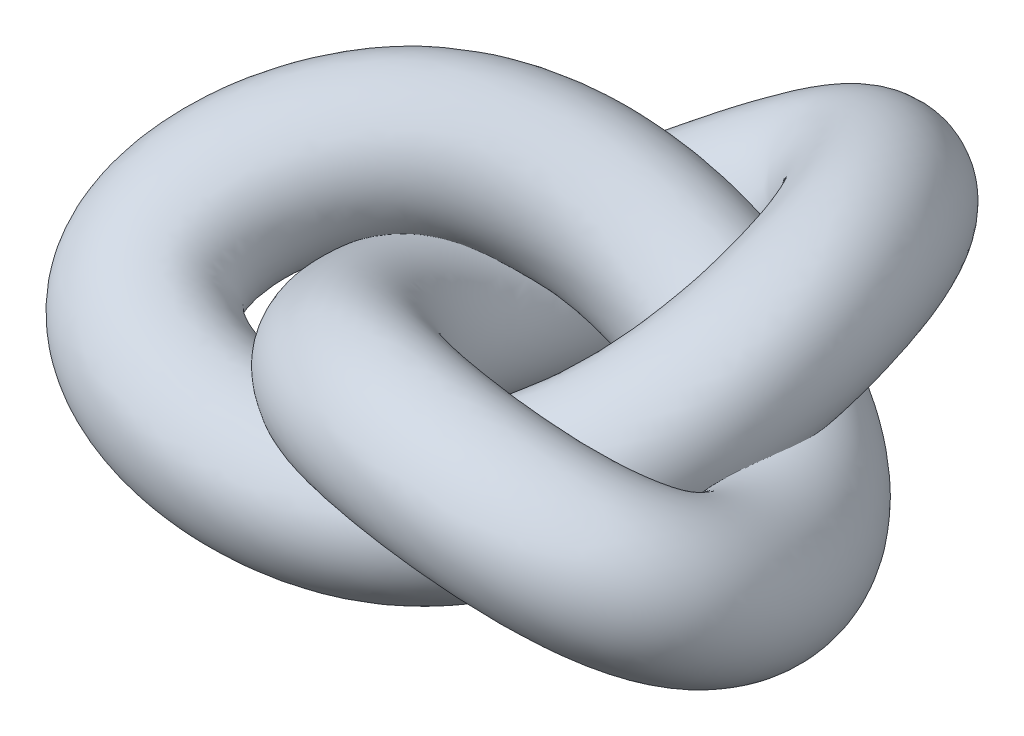
ISO-10303-21;
HEADER;
FILE_DESCRIPTION(('STEP AP214'),'2;1');
FILE_NAME('part.step','',(''),(''),'','','');
FILE_SCHEMA(('AUTOMOTIVE_DESIGN { 1 0 10303 214 1 1 1 1 }'));
ENDSEC;
DATA;
#1=APPLICATION_CONTEXT('core data for automotive mechanical design processes');
#2=APPLICATION_PROTOCOL_DEFINITION('international standard','automotive_design',2000,#1);
#3=PRODUCT_CONTEXT('',#1,'mechanical');
#4=PRODUCT('Part','Part','',(#3));
#5=PRODUCT_RELATED_PRODUCT_CATEGORY('part','',(#4));
#6=PRODUCT_DEFINITION_FORMATION('','',#4);
#7=PRODUCT_DEFINITION_CONTEXT('part definition',#1,'design');
#8=PRODUCT_DEFINITION('design','',#6,#7);
#9=PRODUCT_DEFINITION_SHAPE('','',#8);
#10=(LENGTH_UNIT() NAMED_UNIT(*) SI_UNIT(.MILLI.,.METRE.));
#11=(NAMED_UNIT(*) PLANE_ANGLE_UNIT() SI_UNIT($,.RADIAN.));
#12=(NAMED_UNIT(*) SI_UNIT($,.STERADIAN.) SOLID_ANGLE_UNIT());
#13=UNCERTAINTY_MEASURE_WITH_UNIT(LENGTH_MEASURE(1.E-05),#10,'distance_accuracy_value','');
#14=(GEOMETRIC_REPRESENTATION_CONTEXT(3) GLOBAL_UNCERTAINTY_ASSIGNED_CONTEXT((#13)) GLOBAL_UNIT_ASSIGNED_CONTEXT((#10,
#11,#12)) REPRESENTATION_CONTEXT('',''));
#15=CARTESIAN_POINT('',(0.,0.,0.));
#16=DIRECTION('',(0.,0.,1.));
#17=DIRECTION('',(1.,0.,0.));
#18=AXIS2_PLACEMENT_3D('',#15,#16,#17);
#19=CARTESIAN_POINT('',(-9.62144648483431,37.5336182101547,-84.6410161513775));
#20=CARTESIAN_POINT('',(-11.3289303490066,36.596523336324,-84.7605176670182));
#21=CARTESIAN_POINT('',(-14.7538627109122,34.6863345255906,-84.578142487496));
#22=CARTESIAN_POINT('',(-19.8476880516316,31.7813841620538,-83.0695108729539));
#23=CARTESIAN_POINT('',(-24.8683055121113,28.8783829327885,-80.5134701945312));
#24=CARTESIAN_POINT('',(-31.4097585449315,25.0731534169369,-75.8700388455965));
#25=CARTESIAN_POINT('',(-39.2319767331484,20.4997590547458,-68.0495718002735));
#26=CARTESIAN_POINT('',(-47.2803564132867,16.0466070837544,-56.1454029424881));
#27=CARTESIAN_POINT('',(-52.401825616103,13.4450957254498,-45.6095534719796));
#28=CARTESIAN_POINT('',(-54.8278378175189,13.2871898554675,-36.1270013358128));
#29=CARTESIAN_POINT('',(-55.8610904872362,14.549164952873,-26.5541745109422));
#30=CARTESIAN_POINT('',(-54.5291709322808,19.0083236524051,-12.0321674548432));
#31=CARTESIAN_POINT('',(-48.2325316937717,27.0115358054372,4.47259537285232));
#32=CARTESIAN_POINT('',(-36.8021861381828,35.4824084070533,17.9490665040768));
#33=CARTESIAN_POINT('',(-24.4188620472535,41.6357253617328,27.615123987968));
#34=CARTESIAN_POINT('',(-12.6256887275976,45.7899891928414,34.4640375405679));
#35=CARTESIAN_POINT('',(-0.502211333205655,48.4874796861347,39.5217070755545));
#36=CARTESIAN_POINT('',(8.69192156035237,49.2569440874952,41.8509797186297));
#37=CARTESIAN_POINT('',(18.0958437431056,49.9465274388183,44.2635558231632));
#38=CARTESIAN_POINT('',(28.4358292610102,50.7917176590439,47.187077863681));
#39=CARTESIAN_POINT('',(41.7743767825317,49.788986377683,48.2880371056643));
#40=CARTESIAN_POINT('',(52.8717519772472,48.0043242683964,47.7597437696569));
#41=CARTESIAN_POINT('',(61.6563919138779,45.827012222921,46.0271857861924));
#42=CARTESIAN_POINT('',(69.3021739616228,43.1361825485516,42.9599496181716));
#43=CARTESIAN_POINT('',(74.5529990493121,40.483551565253,39.1337461365941));
#44=CARTESIAN_POINT('',(77.2831566285828,38.5045485461093,35.7850062571938));
#45=CARTESIAN_POINT('',(79.2682058424029,36.711217822612,32.5400555829973));
#46=CARTESIAN_POINT('',(80.9148097447052,34.6319052100543,28.4911652913703));
#47=CARTESIAN_POINT('',(81.9105799351081,31.883248587023,22.5690828387338));
#48=CARTESIAN_POINT('',(81.8730473485386,29.1704845792181,16.1837168275665));
#49=CARTESIAN_POINT('',(80.5111477729819,25.4611189766289,6.70286970036031));
#50=CARTESIAN_POINT('',(76.2094718014637,21.1256987645433,-6.15046863461375));
#51=CARTESIAN_POINT('',(68.5817897085066,17.7003037630106,-19.4637070754559));
#52=CARTESIAN_POINT('',(60.6465334884557,17.1905286351387,-28.1562787120058));
#53=CARTESIAN_POINT('',(51.738955286276,18.3493628602122,-35.2212319650914));
#54=CARTESIAN_POINT('',(39.5599389864686,22.5943864400765,-40.585278561681));
#55=CARTESIAN_POINT('',(24.0282612913617,29.2825962675768,-43.3300779675715));
#56=CARTESIAN_POINT('',(8.31953034386641,36.6564646627721,-41.7296115561908));
#57=CARTESIAN_POINT('',(-6.9519519099956,43.2309162772588,-36.6638880899842));
#58=CARTESIAN_POINT('',(-21.3432274046104,48.2608381225555,-28.9799921411786));
#59=CARTESIAN_POINT('',(-34.607413902969,51.6101108534669,-19.3644272334761));
#60=CARTESIAN_POINT('',(-42.0542455832075,51.8045838418525,-10.9437883206065));
#61=CARTESIAN_POINT('',(-49.8911787692754,52.0392237806501,-2.46543197357951));
#62=CARTESIAN_POINT('',(-58.3221895876288,52.3862824571715,6.16892146786792));
#63=CARTESIAN_POINT('',(-65.8449277378516,50.0546296639679,18.5092900489757));
#64=CARTESIAN_POINT('',(-69.8147184848882,47.4289596359119,27.9854525481757));
#65=CARTESIAN_POINT('',(-71.5844710927103,45.1938498822421,34.594904787388));
#66=CARTESIAN_POINT('',(-72.1757322178538,42.6890381791429,40.8930295561152));
#67=CARTESIAN_POINT('',(-71.5199062743059,40.2013052172776,46.2664937307643));
#68=CARTESIAN_POINT('',(-70.185142231686,38.3480996764326,49.736233988617));
#69=CARTESIAN_POINT('',(-68.3600696672199,36.4973319208486,52.9113800681032));
#70=CARTESIAN_POINT('',(-65.6833491947919,34.4513219470674,56.0390318630295));
#71=CARTESIAN_POINT('',(-60.9930417411155,31.7764046336689,59.4633042345746));
#72=CARTESIAN_POINT('',(-55.3601525629584,29.2149995677876,62.1504306249756));
#73=CARTESIAN_POINT('',(-48.947325125166,26.7930450304974,64.1626354258321));
#74=CARTESIAN_POINT('',(-39.8486223254088,23.9028382034326,65.9219230197057));
#75=CARTESIAN_POINT('',(-27.5425867949933,20.8046902183383,66.6900523355347));
#76=CARTESIAN_POINT('',(-12.4602727955736,18.679555960574,65.0649306351723));
#77=CARTESIAN_POINT('',(-2.28530041779627,17.8520275019645,62.9534986225162));
#78=CARTESIAN_POINT('',(6.63760089027619,19.0912217832023,59.0715887733879));
#79=CARTESIAN_POINT('',(14.3237222939428,22.4477290938865,53.3621073477463));
#80=CARTESIAN_POINT('',(23.4958430139405,27.945755224716,43.8573507020152));
#81=CARTESIAN_POINT('',(29.7076305385308,34.3461596664195,32.4983164863099));
#82=CARTESIAN_POINT('',(33.271094148754,40.3250991416853,20.0034874270694));
#83=CARTESIAN_POINT('',(34.5964017888953,45.2832326218833,6.80295495812949));
#84=CARTESIAN_POINT('',(34.1633395230071,48.992668321838,-6.72016840602324));
#85=CARTESIAN_POINT('',(32.0005541365151,50.6704762690324,-18.3814076026279));
#86=CARTESIAN_POINT('',(29.8516350838521,51.4907204664503,-27.6134322809165));
#87=CARTESIAN_POINT('',(27.4161572597157,52.0006668809013,-37.041703233579));
#88=CARTESIAN_POINT('',(24.1056349564642,52.319719334204,-48.8346336839327));
#89=CARTESIAN_POINT('',(17.7413747443329,50.6312314812898,-62.415310666844));
#90=CARTESIAN_POINT('',(11.1544110863779,47.9994399704101,-72.0127704785029));
#91=CARTESIAN_POINT('',(5.19569895596737,45.2337157808404,-78.0062298571392));
#92=CARTESIAN_POINT('',(0.451321188793008,42.885968902372,-81.5020738558753));
#93=CARTESIAN_POINT('',(-4.50895952587876,40.308903768575,-83.8611333936521));
#94=CARTESIAN_POINT('',(-7.91396262066206,38.4707130839855,-84.5215146357369));
#95=CARTESIAN_POINT('',(-9.62144648483431,37.5336182101547,-84.6410161513775));
#96=CARTESIAN_POINT('',(-10.0661214620548,37.2896060248093,-44.6442322529434));
#97=CARTESIAN_POINT('',(-9.10045651314343,38.035458912549,-44.7240647487324));
#98=CARTESIAN_POINT('',(-7.2407814400291,39.631833121818,-45.2736136509043));
#99=CARTESIAN_POINT('',(-6.35023370511864,41.1045159028261,-46.360399791583));
#100=CARTESIAN_POINT('',(-7.00310511148368,41.9443210218634,-47.0134261108146));
#101=CARTESIAN_POINT('',(-9.52277895903689,42.4262795510612,-46.8698242820826));
#102=CARTESIAN_POINT('',(-14.8587834925092,42.4730405926477,-44.6738214616852));
#103=CARTESIAN_POINT('',(-21.6396812106566,42.4008400906898,-39.6424540976899));
#104=CARTESIAN_POINT('',(-27.1859356120113,42.9801149129314,-35.3599261108876));
#105=CARTESIAN_POINT('',(-28.2703252006773,42.9689679939579,-31.6696936817908));
#106=CARTESIAN_POINT('',(-27.1320057396155,42.7448737299772,-27.9351609911694));
#107=CARTESIAN_POINT('',(-22.5074608766342,42.0981748640669,-21.3031664434062));
#108=CARTESIAN_POINT('',(-13.8886937454248,40.9666792650591,-12.5728763564685));
#109=CARTESIAN_POINT('',(-2.72118048840443,37.6713751207266,-3.97606195134684));
#110=CARTESIAN_POINT('',(6.32994327559552,33.9125864433402,2.64449774908871));
#111=CARTESIAN_POINT('',(13.0447523768264,30.6399313750425,7.28093533293181));
#112=CARTESIAN_POINT('',(18.4530195031551,27.8744726496661,10.4498856559051));
#113=CARTESIAN_POINT('',(21.4326661592502,25.6935819416378,12.0333072252917));
#114=CARTESIAN_POINT('',(24.9553350778416,25.7019077452553,13.0018586550714));
#115=CARTESIAN_POINT('',(29.6326539285643,29.1246698605192,13.2217170569874));
#116=CARTESIAN_POINT('',(36.5337571823551,31.0789402741237,13.0908048498125));
#117=CARTESIAN_POINT('',(41.6273487765548,32.7092787123838,12.3689974598496));
#118=CARTESIAN_POINT('',(44.6453291299583,33.7522272585394,11.6371769854125));
#119=CARTESIAN_POINT('',(45.6250975195992,34.9068785966992,11.3638058042911));
#120=CARTESIAN_POINT('',(44.6185469237102,36.4236159466533,12.3030789538991));
#121=CARTESIAN_POINT('',(43.3987531875406,38.0433330649281,14.372694200553));
#122=CARTESIAN_POINT('',(42.6095584879659,39.4865021128839,16.2629924142136));
#123=CARTESIAN_POINT('',(42.4779801080633,40.9971851416281,18.179471179924));
#124=CARTESIAN_POINT('',(43.2295973470904,42.231583309992,18.9398958557365));
#125=CARTESIAN_POINT('',(44.2032914434463,42.9404159344767,17.957648572446));
#126=CARTESIAN_POINT('',(45.3192742672929,43.5123026186324,14.4826637109192));
#127=CARTESIAN_POINT('',(45.5474727186484,43.8832762094467,7.04424568087125));
#128=CARTESIAN_POINT('',(44.2607773824757,44.7913400289343,-2.18150086348519));
#129=CARTESIAN_POINT('',(41.8881198940163,45.1880033449253,-6.40083196076114));
#130=CARTESIAN_POINT('',(38.183231085937,45.2996877580844,-8.54135255170327));
#131=CARTESIAN_POINT('',(30.7378134715126,44.4570357431238,-7.64686959116972));
#132=CARTESIAN_POINT('',(20.6169862661557,43.5388634494426,-5.625643173023));
#133=CARTESIAN_POINT('',(9.15285036166679,41.2026595029989,-1.49746467219568));
#134=CARTESIAN_POINT('',(-1.98970522331975,37.6710787714338,3.14290312941365));
#135=CARTESIAN_POINT('',(-11.5768069149998,33.5807807595137,7.40990664933427));
#136=CARTESIAN_POINT('',(-18.6872977420599,30.4532215442241,11.4033790369957));
#137=CARTESIAN_POINT('',(-22.0657632994372,26.7596063910573,13.2230754391918));
#138=CARTESIAN_POINT('',(-25.0011762080637,26.7425371444192,16.396650389065));
#139=CARTESIAN_POINT('',(-27.5260443296591,30.8083398833886,21.106813522698));
#140=CARTESIAN_POINT('',(-30.823183322362,32.6564868643894,28.0849285990093));
#141=CARTESIAN_POINT('',(-32.1951517604465,34.1445256477112,32.2407586428756));
#142=CARTESIAN_POINT('',(-32.7132860650239,35.0875055160616,34.175892773522));
#143=CARTESIAN_POINT('',(-32.9646050564262,36.2688984049334,34.5817355594969));
#144=CARTESIAN_POINT('',(-33.398322846059,37.8478859477732,33.3265913463035));
#145=CARTESIAN_POINT('',(-34.595536524178,39.5389177398531,31.2905810551063));
#146=CARTESIAN_POINT('',(-36.07170860818,41.183252219597,29.4078969311177));
#147=CARTESIAN_POINT('',(-38.0360917726051,42.8041033905257,27.8594927758621));
#148=CARTESIAN_POINT('',(-39.6670506703781,44.1291122901971,27.6672515298814));
#149=CARTESIAN_POINT('',(-39.7326920702153,44.7742567677976,28.5928230132107));
#150=CARTESIAN_POINT('',(-38.2083785636899,45.0416374762809,30.0975001883388));
#151=CARTESIAN_POINT('',(-34.5469699929234,45.1995976295988,32.2511906891897));
#152=CARTESIAN_POINT('',(-27.7842545631354,45.492522881275,34.9417178285822));
#153=CARTESIAN_POINT('',(-18.8514486709762,46.0228330287741,36.189917594407));
#154=CARTESIAN_POINT('',(-13.0251679800172,47.3262111353401,37.954645145305));
#155=CARTESIAN_POINT('',(-9.26806572298971,47.5804691444614,35.7971009846742));
#156=CARTESIAN_POINT('',(-7.60858208110123,46.7535686461891,29.606242606353));
#157=CARTESIAN_POINT('',(-5.00994275284035,45.8981693250335,21.6373832984144));
#158=CARTESIAN_POINT('',(-3.72897246122122,43.668657296537,11.7580306730818));
#159=CARTESIAN_POINT('',(-2.87271847487518,40.1975727301339,1.89074883901168));
#160=CARTESIAN_POINT('',(-2.13965586641532,35.8940926166902,-7.16457501965451));
#161=CARTESIAN_POINT('',(-1.55349506215907,31.8271902628234,-14.6882141903864));
#162=CARTESIAN_POINT('',(-1.19844343851734,27.9544148230206,-20.0236350911559));
#163=CARTESIAN_POINT('',(-1.41974517312342,26.7702827159152,-23.4516974117049));
#164=CARTESIAN_POINT('',(-2.33336756053505,26.8937292238336,-27.0908264161792));
#165=CARTESIAN_POINT('',(-5.02963265012253,29.7553900461913,-32.6300690713215));
#166=CARTESIAN_POINT('',(-9.19233884033595,31.3636151234364,-39.5153928605331));
#167=CARTESIAN_POINT('',(-12.5802975100908,32.3014486690674,-43.5483079604548));
#168=CARTESIAN_POINT('',(-14.1039645787018,33.0086657278867,-44.9940173677273));
#169=CARTESIAN_POINT('',(-14.227028326472,33.8168803464847,-45.1892633858247));
#170=CARTESIAN_POINT('',(-13.0347711334971,35.1567157953799,-44.7946186761702));
#171=CARTESIAN_POINT('',(-11.0317864109661,36.5437531370697,-44.5643997571544));
#172=CARTESIAN_POINT('',(-10.0661214620548,37.2896060248093,-44.6442322529434));
#173=CARTESIAN_POINT('',(9.17677150761384,2.22236960449988,-44.6442322529434));
#174=CARTESIAN_POINT('',(10.2903010683954,3.04961297743135,-44.532322114054));
#175=CARTESIAN_POINT('',(12.4813586797663,4.8337570150139,-44.6314875157738));
#176=CARTESIAN_POINT('',(13.9375826505144,6.65117882030913,-45.0461443369467));
#177=CARTESIAN_POINT('',(13.9682972427893,7.94035247361961,-44.9174399038484));
#178=CARTESIAN_POINT('',(12.5518671828934,9.2016655623305,-43.6127548116536));
#179=CARTESIAN_POINT('',(9.08941843933265,10.751543142312,-39.798065722579));
#180=CARTESIAN_POINT('',(4.67475251957003,12.8437957386378,-33.2421685808004));
#181=CARTESIAN_POINT('',(1.53339614662897,16.0466748771984,-28.343825186792));
#182=CARTESIAN_POINT('',(0.607089466952626,16.113633166124,-24.8588156489444));
#183=CARTESIAN_POINT('',(0.725748265350353,14.7152411530153,-21.6031665974941));
#184=CARTESIAN_POINT('',(1.91594552526386,10.8465983125268,-15.017474004546));
#185=CARTESIAN_POINT('',(4.42908243179172,5.9021299220227,-4.49071415434053));
#186=CARTESIAN_POINT('',(7.5532320877012,0.665706265198119,8.24235736467889));
#187=CARTESIAN_POINT('',(10.4213815587043,-2.54899597536637,18.9320804480976));
#188=CARTESIAN_POINT('',(13.123304535703,-4.36508842965077,26.8229802660286));
#189=CARTESIAN_POINT('',(16.0173050057364,-5.48537433726285,32.4830074041381));
#190=CARTESIAN_POINT('',(17.9217212897221,-6.29706302273508,35.7979139244643));
#191=CARTESIAN_POINT('',(20.9679013760624,-6.17882175915121,36.8247068795036));
#192=CARTESIAN_POINT('',(25.9405125568991,-4.57488374553905,34.5744812759425));
#193=CARTESIAN_POINT('',(32.1954800172196,-3.79341721899559,32.2448987784431));
#194=CARTESIAN_POINT('',(36.4632834328675,-3.09941618894167,29.4693443090709));
#195=CARTESIAN_POINT('',(38.5477470991751,-2.52817639785645,27.3631491471686));
#196=CARTESIAN_POINT('',(38.476307195456,-1.56423621461892,26.172528258512));
#197=CARTESIAN_POINT('',(36.526489995073,0.0190375825582278,26.775127195199));
#198=CARTESIAN_POINT('',(34.7153933869743,1.79035800706455,28.8777702860503));
#199=CARTESIAN_POINT('',(33.3801531278824,3.39754800731101,30.8407767440607));
#200=CARTESIAN_POINT('',(32.5675470055634,5.12757835566574,32.859406071943));
#201=CARTESIAN_POINT('',(32.3159126168968,6.73496961710964,33.8172656574209));
#202=CARTESIAN_POINT('',(32.1085160618061,7.94376253573501,33.1130331054183));
#203=CARTESIAN_POINT('',(31.310123449245,9.47709219289529,30.2180169562993));
#204=CARTESIAN_POINT('',(28.7975187814945,11.5848559957468,23.9356679909162));
#205=CARTESIAN_POINT('',(24.9132431057614,15.3620983122331,16.804077597777));
#206=CARTESIAN_POINT('',(22.1998680060005,16.5566193488657,13.4788190731164));
#207=CARTESIAN_POINT('',(19.0202866958706,16.226073484159,11.1311379119249));
#208=CARTESIAN_POINT('',(13.4638459910434,12.3235778789694,9.12811277356716));
#209=CARTESIAN_POINT('',(4.58311630935662,8.63024994098244,6.14747221246182));
#210=CARTESIAN_POINT('',(-6.21089776956542,4.26683177500033,3.02878784609418));
#211=CARTESIAN_POINT('',(-17.5236582826163,0.696739224062628,-0.0695146814769078));
#212=CARTESIAN_POINT('',(-28.0489549507074,-1.68253195150849,-2.34564890720073));
#213=CARTESIAN_POINT('',(-36.0617120272955,-2.91303977521169,-2.51999911898807));
#214=CARTESIAN_POINT('',(-41.1561634124756,-4.33451209273137,-3.17474840817047));
#215=CARTESIAN_POINT('',(-43.7500110931134,-4.31453095236322,-0.453840462714506));
#216=CARTESIAN_POINT('',(-43.6496081272656,-2.68064373216213,6.00401281928596));
#217=CARTESIAN_POINT('',(-44.0479855491905,-2.14039963212092,13.3660530484103));
#218=CARTESIAN_POINT('',(-43.0974248851607,-1.45523005754516,17.5855413814382));
#219=CARTESIAN_POINT('',(-42.1908953605494,-0.820962691296452,19.2990714104911));
#220=CARTESIAN_POINT('',(-41.2992076259126,0.264383824340147,19.2639254701653));
#221=CARTESIAN_POINT('',(-40.978988476787,1.9371240521943,17.4148091710898));
#222=CARTESIAN_POINT('',(-41.8941692395698,3.7981222563589,14.8776337702673));
#223=CARTESIAN_POINT('',(-43.19313127874,5.63775033824166,12.4991588574323));
#224=CARTESIAN_POINT('',(-45.0862037062126,7.49767815841116,10.4246185467055));
#225=CARTESIAN_POINT('',(-46.573388873324,9.19778500620715,9.43528561738221));
#226=CARTESIAN_POINT('',(-46.496639472838,10.307175575078,9.4429068315139));
#227=CARTESIAN_POINT('',(-44.839890563308,11.1773469215577,9.85449751607658));
#228=CARTESIAN_POINT('',(-41.0676079203775,12.3076209008584,10.396777854591));
#229=CARTESIAN_POINT('',(-34.4666269535651,14.3141689008341,10.737369810401));
#230=CARTESIAN_POINT('',(-25.9394526109031,16.6414703389396,9.88422110807125));
#231=CARTESIAN_POINT('',(-21.4221777593895,20.2909900309766,9.6767503507133));
#232=CARTESIAN_POINT('',(-17.6297571343259,20.1499185192401,7.9264068580134));
#233=CARTESIAN_POINT('',(-14.5524653011437,16.1116564847192,4.58505165976424));
#234=CARTESIAN_POINT('',(-8.94229025066223,12.5293063601579,-0.305075428943315));
#235=CARTESIAN_POINT('',(-2.66401751146069,7.68673705630578,-6.19250924116512));
#236=CARTESIAN_POINT('',(4.32465848599093,3.24096253675895,-12.2486565872502));
#237=CARTESIAN_POINT('',(11.2782981807568,-0.323370910813289,-18.1908186168625));
#238=CARTESIAN_POINT('',(16.9869904186607,-2.60471916990157,-23.722499112577));
#239=CARTESIAN_POINT('',(21.1688247873855,-4.18005723309631,-28.3108045707108));
#240=CARTESIAN_POINT('',(22.2235961507074,-4.50454068684798,-31.4876369119733));
#241=CARTESIAN_POINT('',(21.4276748076852,-4.34218483816656,-34.7793948272125));
#242=CARTESIAN_POINT('',(16.7560212876348,-3.18458342431744,-39.2927005688756));
#243=CARTESIAN_POINT('',(10.9937736721235,-2.83648141751936,-44.4907361242898));
#244=CARTESIAN_POINT('',(6.52402840099115,-2.69661798481318,-46.8834865426779));
#245=CARTESIAN_POINT('',(4.61839760376341,-2.28013525281156,-47.0973185734061));
#246=CARTESIAN_POINT('',(4.43578511295592,-1.54317343223383,-46.4516306752888));
#247=CARTESIAN_POINT('',(5.80018131507667,-0.129703222574929,-45.3029483491101));
#248=CARTESIAN_POINT('',(8.06324194683224,1.39512623156841,-44.7561423918328));
#249=CARTESIAN_POINT('',(9.17677150761384,2.22236960449988,-44.6442322529434));
#250=CARTESIAN_POINT('',(9.6214464848343,2.46638178984526,-84.6410161513775));
#251=CARTESIAN_POINT('',(8.06182723253232,1.61067740120631,-84.5687750323398));
#252=CARTESIAN_POINT('',(4.96827740888312,-0.111741581213598,-83.9360163523656));
#253=CARTESIAN_POINT('',(0.440128304001379,-2.67195292046323,-81.7552554183176));
#254=CARTESIAN_POINT('',(-3.89690315783837,-5.1255856154553,-78.417483987565));
#255=CARTESIAN_POINT('',(-9.33511240300122,-8.15146057179386,-72.6129693751676));
#256=CARTESIAN_POINT('',(-15.2837748013065,-11.2217383955899,-63.1738160611674));
#257=CARTESIAN_POINT('',(-20.9659226830601,-13.5104372682977,-49.7451174255986));
#258=CARTESIAN_POINT('',(-23.6824938574628,-13.4883443102831,-38.5934525478839));
#259=CARTESIAN_POINT('',(-25.950423149889,-13.5681449723665,-29.3161233029664));
#260=CARTESIAN_POINT('',(-28.0033364822703,-13.4804676240889,-20.2221801172669));
#261=CARTESIAN_POINT('',(-30.1057645303827,-12.243252899135,-5.746475015983));
#262=CARTESIAN_POINT('',(-29.9147555165552,-8.05301353759921,12.5547575749803));
#263=CARTESIAN_POINT('',(-26.5277735620772,-1.52326044847514,30.1674858201025));
#264=CARTESIAN_POINT('',(-20.3274237641448,5.17414294302622,43.9027066869769));
#265=CARTESIAN_POINT('',(-12.547136568721,10.7849693881481,54.0060824736646));
#266=CARTESIAN_POINT('',(-2.93792583062433,15.1276326992058,61.5548288237876));
#267=CARTESIAN_POINT('',(5.18097669082424,17.2662991231223,65.6155864178024));
#268=CARTESIAN_POINT('',(14.1084100413263,18.0657979344118,68.0864040475955));
#269=CARTESIAN_POINT('',(24.743687889345,17.0921640529856,68.5398420826361));
#270=CARTESIAN_POINT('',(37.4360996173962,14.9166288845638,67.4421310342948));
#271=CARTESIAN_POINT('',(47.7076866335599,12.195629367071,64.8600906188782));
#272=CARTESIAN_POINT('',(55.5588098830947,9.54660856652514,61.7531579479486));
#273=CARTESIAN_POINT('',(62.1533836374796,6.66506773723352,57.7686720723926));
#274=CARTESIAN_POINT('',(66.4609421206749,4.07897320115794,53.605794377894));
#275=CARTESIAN_POINT('',(68.5997968280166,2.25157348824581,50.2900823426911));
#276=CARTESIAN_POINT('',(70.0388004823194,0.622263717039071,47.1178399128443));
#277=CARTESIAN_POINT('',(71.0043766422053,-1.2377015759081,43.1711001833892));
#278=CARTESIAN_POINT('',(70.9968952049144,-3.61336510585938,37.4464526404183));
#279=CARTESIAN_POINT('',(69.7782719668983,-5.82616881952357,31.3391013605388));
#280=CARTESIAN_POINT('',(66.501996954934,-8.57409144910825,22.4382229457405));
#281=CARTESIAN_POINT('',(59.4595178643098,-11.1727214491566,10.7409536754312));
#282=CARTESIAN_POINT('',(49.2342554317923,-11.7289379536906,-0.478128614193714));
#283=CARTESIAN_POINT('',(40.95828160044,-11.440855360921,-8.27662767812828));
#284=CARTESIAN_POINT('',(32.5760108962096,-10.7242514137132,-15.5487415014632));
#285=CARTESIAN_POINT('',(22.2859715059994,-9.53907142407791,-23.8102961969441));
#286=CARTESIAN_POINT('',(7.99439133456262,-5.6260172408833,-31.5569625820867));
#287=CARTESIAN_POINT('',(-7.04421778736581,-0.279363065226497,-37.2033590379009));
#288=CARTESIAN_POINT('',(-22.4859049692921,6.25657672988768,-39.8763059008748));
#289=CARTESIAN_POINT('',(-37.8153754403181,12.9975254115334,-38.7355476977136));
#290=CARTESIAN_POINT('',(-51.9818281882046,18.243849534031,-33.2878053894599));
#291=CARTESIAN_POINT('',(-61.1446456962459,20.7104653580639,-27.3416121679687));
#292=CARTESIAN_POINT('',(-68.6400136543251,20.9821556838677,-19.315922825359));
#293=CARTESIAN_POINT('',(-74.4457533852353,18.8972988416207,-8.9338792355441));
#294=CARTESIAN_POINT('',(-79.0697299646802,15.2577431674576,3.79041449837676));
#295=CARTESIAN_POINT('',(-80.7169916096024,11.8292039306556,13.3302352867383));
#296=CARTESIAN_POINT('',(-81.0620803882358,9.28538167488408,19.718083424357));
#297=CARTESIAN_POINT('',(-80.5103347873401,6.68452359854966,25.5752194667836));
#298=CARTESIAN_POINT('',(-79.1005719050338,4.29054332169868,30.3547115555507));
#299=CARTESIAN_POINT('',(-77.4837749470778,2.60730419293838,33.3232867037779));
#300=CARTESIAN_POINT('',(-75.4814923377799,0.951830039493206,36.0026419944178));
#301=CARTESIAN_POINT('',(-72.7334611283994,-0.855103285047046,38.6041576338729));
#302=CARTESIAN_POINT('',(-67.8993799440614,-3.15492265032112,41.2313383220754));
#303=CARTESIAN_POINT('',(-62.1240999655811,-5.25208162493204,43.0005144432788));
#304=CARTESIAN_POINT('',(-55.578837124784,-7.0712455242258,43.9196327535699));
#305=CARTESIAN_POINT('',(-46.3692602528629,-8.98913852530779,44.067510185107));
#306=CARTESIAN_POINT('',(-34.224959185423,-10.3736637621027,42.4857043173535));
#307=CARTESIAN_POINT('',(-19.5482767355004,-10.7018067292605,38.7592341488365));
#308=CARTESIAN_POINT('',(-10.6823101971686,-9.18319360239898,34.6756038279245));
#309=CARTESIAN_POINT('',(-1.72409052106004,-8.33932884201901,31.200894646727));
#310=CARTESIAN_POINT('',(7.37983907390036,-8.19418306758341,28.3409164011575));
#311=CARTESIAN_POINT('',(19.5634955161187,-5.42310774015959,21.9148919746575));
#312=CARTESIAN_POINT('',(30.7725854882913,-1.63576057381172,14.5477765720629));
#313=CARTESIAN_POINT('',(40.4684711096201,3.36848894831043,5.86408200080754));
#314=CARTESIAN_POINT('',(48.0143558360675,9.06576909437976,-4.22328863907849));
#315=CARTESIAN_POINT('',(52.7038250038269,14.5607588891131,-15.7544533282138));
#316=CARTESIAN_POINT('',(54.367822362418,18.5360042129155,-26.6685770821828));
#317=CARTESIAN_POINT('',(53.4949764076829,20.2158970636871,-35.6493717811849));
#318=CARTESIAN_POINT('',(51.1771996279359,20.7647528189011,-44.7302716446123));
#319=CARTESIAN_POINT('',(45.8912888942215,19.3797458636954,-55.4972651814869));
#320=CARTESIAN_POINT('',(37.9274872567924,16.431134940334,-67.3906539306007));
#321=CARTESIAN_POINT('',(30.2587369974599,13.0013733165295,-75.3479490607261));
#322=CARTESIAN_POINT('',(23.9180611384326,9.94491480014207,-80.109531062818));
#323=CARTESIAN_POINT('',(19.1141346282209,7.52591512365348,-82.7644411453394));
#324=CARTESIAN_POINT('',(14.325992922695,5.0224847506201,-84.3694630665919));
#325=CARTESIAN_POINT('',(11.1810657371363,3.32208617848421,-84.7132572704152));
#326=CARTESIAN_POINT('',(9.6214464848343,2.46638178984526,-84.6410161513775));
#327=CARTESIAN_POINT('',(10.0661214620548,2.71039397519065,-124.637800049812));
#328=CARTESIAN_POINT('',(5.83335339666921,0.171741824981281,-124.605227950626));
#329=CARTESIAN_POINT('',(-2.54480386200001,-5.05724017744109,-123.240545188957));
#330=CARTESIAN_POINT('',(-13.0573260425116,-11.9950846612356,-118.464366499688));
#331=CARTESIAN_POINT('',(-21.762103558466,-18.1915237045302,-111.917528071282));
#332=CARTESIAN_POINT('',(-31.2220919888958,-25.5045867059182,-101.613183938682));
#333=CARTESIAN_POINT('',(-39.6569680419456,-33.1950199334918,-86.5495663997557));
#334=CARTESIAN_POINT('',(-46.6065978856902,-39.8646702752332,-66.2480662703969));
#335=CARTESIAN_POINT('',(-48.8983838615545,-43.0233634977647,-48.8430799089759));
#336=CARTESIAN_POINT('',(-52.5079357667306,-43.2499231108569,-33.7734309569884));
#337=CARTESIAN_POINT('',(-56.732421229891,-41.6761764011931,-18.8411936370398));
#338=CARTESIAN_POINT('',(-62.1274745860294,-35.3331041107968,3.52452397258));
#339=CARTESIAN_POINT('',(-64.2585934649021,-22.0081569972211,29.600229304301));
#340=CARTESIAN_POINT('',(-60.6087792118555,-3.7122271621484,52.0926142755261));
#341=CARTESIAN_POINT('',(-51.0762290869938,12.8972818614188,68.8733329258563));
#342=CARTESIAN_POINT('',(-38.2175776731449,25.9350272059471,81.1891846813006));
#343=CARTESIAN_POINT('',(-21.893156666985,35.7406397356743,90.6266502434371));
#344=CARTESIAN_POINT('',(-7.55976790807364,40.8296612689796,95.4332589111405));
#345=CARTESIAN_POINT('',(7.24891870659027,42.3104176279748,99.3481012156873));
#346=CARTESIAN_POINT('',(23.5468632217908,38.7592118515103,102.50520288933));
#347=CARTESIAN_POINT('',(42.6767192175728,33.6266749881231,102.639363290146));
#348=CARTESIAN_POINT('',(58.9520898342522,27.4906749230836,100.250836928686));
#349=CARTESIAN_POINT('',(72.5698726670144,21.6213935309067,96.1431667487285));
#350=CARTESIAN_POINT('',(85.8304600795033,14.894371689086,89.3648158862731));
#351=CARTESIAN_POINT('',(96.3953942462768,8.13890881975764,80.4364615605889));
#352=CARTESIAN_POINT('',(102.484200269059,2.71278896942706,71.7023943993319));
#353=CARTESIAN_POINT('',(106.697447836756,-2.15302057323286,63.394903081628));
#354=CARTESIAN_POINT('',(109.441206278847,-7.60298150748193,53.4827942948355));
#355=CARTESIAN_POINT('',(109.677877792932,-13.9616998288284,41.0756396234155));
#356=CARTESIAN_POINT('',(107.448027871991,-19.5961001747822,29.5651696156593));
#357=CARTESIAN_POINT('',(101.693870460623,-26.6252750911118,14.6584289351816));
#358=CARTESIAN_POINT('',(90.1215169471252,-33.93029889406,-2.4537606400538));
#359=CARTESIAN_POINT('',(73.5552677578231,-38.8199742196143,-17.7603348261644));
#360=CARTESIAN_POINT('',(59.7166951948794,-39.4383300707076,-30.0320744293729));
#361=CARTESIAN_POINT('',(46.1317350965486,-37.6745763115854,-42.2286209148513));
#362=CARTESIAN_POINT('',(31.1080970209553,-31.4017207271252,-56.7487051674553));
#363=CARTESIAN_POINT('',(11.4056663597686,-19.882284422749,-69.2613973766352));
#364=CARTESIAN_POINT('',(-7.87753780516619,-4.82555790545333,-77.435505921896));
#365=CARTESIAN_POINT('',(-27.448151655968,11.8164142357127,-79.6830971202726));
#366=CARTESIAN_POINT('',(-47.5817959299288,27.6775827745753,-75.1254464882265));
#367=CARTESIAN_POINT('',(-67.9019443491138,39.4007388432737,-64.0556116599316));
#368=CARTESIAN_POINT('',(-81.133127980016,45.7554428088591,-51.508475927767));
#369=CARTESIAN_POINT('',(-93.5300162155368,46.2788423200987,-38.1780051880035));
#370=CARTESIAN_POINT('',(-105.241898643205,40.4752414154036,-23.8717712903742));
#371=CARTESIAN_POINT('',(-114.09147438017,32.6558859670362,-5.78522405165678));
#372=CARTESIAN_POINT('',(-118.336558334044,25.1136379188563,9.07492919203842));
#373=CARTESIAN_POINT('',(-119.933265415922,19.3917260410646,20.1370954382229));
#374=CARTESIAN_POINT('',(-119.721461948768,13.1046633727592,31.8865134634018));
#375=CARTESIAN_POINT('',(-117.222155333281,6.64396259120306,43.2946139400115));
#376=CARTESIAN_POINT('',(-113.073380654586,1.41648612951787,51.7689396372885));
#377=CARTESIAN_POINT('',(-107.76985339682,-3.73409025925525,59.5061251314033));
#378=CARTESIAN_POINT('',(-100.380718550586,-9.20788472850526,66.7836967210404));
#379=CARTESIAN_POINT('',(-89.2253710147987,-15.5076303068494,73.0273910267686));
#380=CARTESIAN_POINT('',(-77.7515604583242,-20.8113388249421,76.5581220550437));
#381=CARTESIAN_POINT('',(-66.31778368626,-25.3198379700093,77.9847679910631));
#382=CARTESIAN_POINT('',(-51.6709125853483,-30.285897951474,77.7382425156229));
#383=CARTESIAN_POINT('',(-33.9832914172809,-35.0614964250394,74.234038824306));
#384=CARTESIAN_POINT('',(-13.1571008600977,-38.0450837974606,67.6342471896017));
#385=CARTESIAN_POINT('',(0.0575573650522605,-38.6573772357746,59.6744573051357));
#386=CARTESIAN_POINT('',(14.1815760922058,-36.8285762032781,54.4753824354406));
#387=CARTESIAN_POINT('',(29.3121434489444,-32.500022619886,52.0967811425507));
#388=CARTESIAN_POINT('',(48.0692812828995,-23.3755218404771,44.1348593782584));
#389=CARTESIAN_POINT('',(64.2091884880433,-10.9582582039292,35.2880623852909));
#390=CARTESIAN_POINT('',(76.6122837332492,3.4960153598619,23.9768205888653));
#391=CARTESIAN_POINT('',(84.7504134913781,18.4549090995728,9.7442413387055));
#392=CARTESIAN_POINT('',(88.4206595889931,31.7262369481277,-7.78640754385064));
#393=CARTESIAN_POINT('',(87.5668199374504,41.2520656589272,-25.0263495936548));
#394=CARTESIAN_POINT('',(84.7663566646584,44.9363348142222,-39.8111066503964));
#395=CARTESIAN_POINT('',(80.9267244481866,45.8716904759687,-54.681148462012));
#396=CARTESIAN_POINT('',(75.0265565008083,41.9440751517082,-71.7018297940981));
#397=CARTESIAN_POINT('',(64.8612008414613,35.6987512981873,-90.2905717369117));
#398=CARTESIAN_POINT('',(53.9934455939286,28.6993646178721,-103.812411578774));
#399=CARTESIAN_POINT('',(43.2177246731017,22.1699648530957,-113.12174355223));
#400=CARTESIAN_POINT('',(33.7924841434859,16.5950036795408,-119.07725161539));
#401=CARTESIAN_POINT('',(22.8518045303134,10.1746727238151,-123.435977784074));
#402=CARTESIAN_POINT('',(14.2988895274403,5.24904612540002,-124.670372148998));
#403=CARTESIAN_POINT('',(10.0661214620548,2.71039397519065,-124.637800049812));
#404=CARTESIAN_POINT('',(-9.17677150761385,37.7776303955001,-124.637800049812));
#405=CARTESIAN_POINT('',(-13.5574041848697,35.157587760099,-124.796970585304));
#406=CARTESIAN_POINT('',(-22.2669439817954,29.7408359293631,-123.882671324088));
#407=CARTESIAN_POINT('',(-33.3451423981446,22.4582524212814,-119.778621954325));
#408=CARTESIAN_POINT('',(-42.733505912739,15.8124448437136,-114.013514278248));
#409=CARTESIAN_POINT('',(-53.2967381308261,7.72002728281257,-104.870253409111));
#410=CARTESIAN_POINT('',(-63.6051699737875,-1.47352248315608,-91.4253221388619));
#411=CARTESIAN_POINT('',(-72.9210316159168,-10.3076259231811,-72.6483517872864));
#412=CARTESIAN_POINT('',(-77.6177156201947,-16.0899234620318,-55.8591808330715));
#413=CARTESIAN_POINT('',(-81.3853504343605,-16.394588283023,-40.5843089898348));
#414=CARTESIAN_POINT('',(-84.5901752348568,-13.6465438242312,-25.173188030715));
#415=CARTESIAN_POINT('',(-86.5508809879274,-4.08152755925662,-2.76116846628022));
#416=CARTESIAN_POINT('',(-82.5763696421186,13.0563923458153,21.5180671021731));
#417=CARTESIAN_POINT('',(-70.8831917879612,33.2934416933801,39.8741949595004));
#418=CARTESIAN_POINT('',(-55.1676673701026,49.3588642801254,52.5857502268474));
#419=CARTESIAN_POINT('',(-38.2961298320215,60.9400470106403,61.6471397482039));
#420=CARTESIAN_POINT('',(-19.4574421695664,69.1004867226033,68.593528495204));
#421=CARTESIAN_POINT('',(-4.04882303854551,72.8203062333526,71.6686522119678));
#422=CARTESIAN_POINT('',(11.2363524083695,74.1911471323813,75.525252991255));
#423=CARTESIAN_POINT('',(27.239004593456,72.4587654575686,81.1524386703745));
#424=CARTESIAN_POINT('',(47.0149963827083,68.4990324812424,83.485269361516));
#425=CARTESIAN_POINT('',(64.1161551779395,63.2993698244091,83.1504900794642));
#426=CARTESIAN_POINT('',(78.6674546977976,57.9017971873026,80.4171945869724));
#427=CARTESIAN_POINT('',(92.9792504036464,51.3654865004041,74.5560934320523));
#428=CARTESIAN_POINT('',(104.487451174914,44.5434871838527,65.964413319289));
#429=CARTESIAN_POINT('',(111.167560069625,38.9657640272906,57.1973183138346));
#430=CARTESIAN_POINT('',(115.92685319684,33.93593353234,48.8171187517809));
#431=CARTESIAN_POINT('',(119.351639381347,28.2666252784805,38.8028594028165));
#432=CARTESIAN_POINT('',(120.591562523126,21.534913864054,26.198269821731));
#433=CARTESIAN_POINT('',(119.542803253631,15.4005532239596,14.409785082687));
#434=CARTESIAN_POINT('',(115.703021278671,7.40993533462531,-1.07692431019857));
#435=CARTESIAN_POINT('',(106.871470884279,-1.63187868036003,-19.3451829500987));
#436=CARTESIAN_POINT('',(92.9028020345375,-9.39073250291307,-36.7459132874266));
#437=CARTESIAN_POINT('',(79.4049470828951,-10.806946074648,-49.9117254632504));
#438=CARTESIAN_POINT('',(65.294679486615,-8.60096203766003,-61.9011113784795));
#439=CARTESIAN_POINT('',(48.3820645014245,0.731737137029243,-73.5236875321921));
#440=CARTESIAN_POINT('',(27.4395363165677,15.0263290857111,-81.03451276212));
#441=CARTESIAN_POINT('',(7.48621032606602,32.1102698225453,-81.9617584401859));
#442=CARTESIAN_POINT('',(-11.9141985966715,48.7907537830839,-76.4706793093821));
#443=CARTESIAN_POINT('',(-31.1096478942211,62.9408954855975,-65.3698909316915));
#444=CARTESIAN_POINT('',(-50.5275300638781,72.7670001627095,-50.1322335039479));
#445=CARTESIAN_POINT('',(-62.0427278669776,76.8495612926477,-35.1106520804048));
#446=CARTESIAN_POINT('',(-74.7811813304871,77.3359104168811,-21.327514336224));
#447=CARTESIAN_POINT('',(-89.1183348455985,73.9642250309543,-8.76897058696215));
#448=CARTESIAN_POINT('',(-100.866672153341,67.4527724635465,8.93365149894221));
#449=CARTESIAN_POINT('',(-107.43428520933,60.7133936241127,23.7301464534758));
#450=CARTESIAN_POINT('',(-110.455656120397,55.3001942484226,35.0139168012539));
#451=CARTESIAN_POINT('',(-111.386859379281,49.1091779533524,47.2043235527335));
#452=CARTESIAN_POINT('',(-109.641489702553,42.554724486782,59.2063961152252));
#453=CARTESIAN_POINT('',(-105.774747939194,37.1572816130121,68.1818869221275));
#454=CARTESIAN_POINT('',(-100.64843072626,31.8114116221001,76.4148632050887));
#455=CARTESIAN_POINT('',(-93.3306066169788,26.0985405036092,84.218570950197));
#456=CARTESIAN_POINT('',(-82.3190328118527,19.4236969771406,91.2593569392678));
#457=CARTESIAN_POINT('',(-70.9876130557016,13.6557423677776,95.7080382367405));
#458=CARTESIAN_POINT('',(-59.686271686642,8.54445258471388,98.2277706633254));
#459=CARTESIAN_POINT('',(-45.1502746578942,2.60607877726636,99.5926553502216));
#460=CARTESIAN_POINT('',(-27.3009190268512,-3.88314244459841,98.4383868424872));
#461=CARTESIAN_POINT('',(-6.06909692017089,-8.66372110762614,93.9399436759375));
#462=CARTESIAN_POINT('',(8.45456714442462,-11.6221561314111,87.9523520997273));
#463=CARTESIAN_POINT('',(22.5432675035421,-9.39802557805683,82.3460765621014));
#464=CARTESIAN_POINT('',(36.2560266689868,-1.85811045841611,77.1179720891396));
#465=CARTESIAN_POINT('',(52.0016287807214,9.99334112439847,66.0773181056161));
#466=CARTESIAN_POINT('',(63.1442335382828,25.023662036302,53.2386022995379));
#467=CARTESIAN_POINT('',(69.4149067723831,40.4526255532368,38.1162260151271));
#468=CARTESIAN_POINT('',(71.332459444206,54.6723726270763,20.7704849359135));
#469=CARTESIAN_POINT('',(69.8801741081733,66.1581463808526,1.24787737833994));
#470=CARTESIAN_POINT('',(65.1995517115475,73.3865377150441,-16.7391801140999));
#471=CARTESIAN_POINT('',(61.1230153408276,76.2111582169854,-31.775167150128));
#472=CARTESIAN_POINT('',(57.1656820799664,77.1076045379689,-46.9925800509787));
#473=CARTESIAN_POINT('',(53.240902563051,74.8840486222169,-65.039198296544));
#474=CARTESIAN_POINT('',(44.6750883290018,69.8988478391431,-85.3152284731549));
#475=CARTESIAN_POINT('',(34.8891196828466,63.6974312717527,-100.477232996551));
#476=CARTESIAN_POINT('',(24.4953624906365,57.458765833794,-111.018442346551));
#477=CARTESIAN_POINT('',(15.129670704058,51.9550574582593,-117.814884325926));
#478=CARTESIAN_POINT('',(4.01685208173958,45.46109174177,-122.927648111134));
#479=CARTESIAN_POINT('',(-4.79613883035802,40.3976730309013,-124.478629514319));
#480=CARTESIAN_POINT('',(-9.17677150761385,37.7776303955001,-124.637800049812));
#481=CARTESIAN_POINT('',(-9.62144648483431,37.5336182101547,-84.6410161513775));
#482=CARTESIAN_POINT('',(-11.3289303490066,36.596523336324,-84.7605176670182));
#483=CARTESIAN_POINT('',(-14.7538627109122,34.6863345255906,-84.578142487496));
#484=CARTESIAN_POINT('',(-19.8476880516316,31.7813841620538,-83.0695108729539));
#485=CARTESIAN_POINT('',(-24.8683055121113,28.8783829327885,-80.5134701945312));
#486=CARTESIAN_POINT('',(-31.4097585449315,25.0731534169369,-75.8700388455965));
#487=CARTESIAN_POINT('',(-39.2319767331484,20.4997590547458,-68.0495718002735));
#488=CARTESIAN_POINT('',(-47.2803564132867,16.0466070837544,-56.1454029424881));
#489=CARTESIAN_POINT('',(-52.401825616103,13.4450957254498,-45.6095534719796));
#490=CARTESIAN_POINT('',(-54.8278378175189,13.2871898554675,-36.1270013358128));
#491=CARTESIAN_POINT('',(-55.8610904872362,14.549164952873,-26.5541745109422));
#492=CARTESIAN_POINT('',(-54.5291709322808,19.0083236524051,-12.0321674548432));
#493=CARTESIAN_POINT('',(-48.2325316937717,27.0115358054372,4.47259537285232));
#494=CARTESIAN_POINT('',(-36.8021861381828,35.4824084070533,17.9490665040768));
#495=CARTESIAN_POINT('',(-24.4188620472535,41.6357253617328,27.615123987968));
#496=CARTESIAN_POINT('',(-12.6256887275976,45.7899891928414,34.4640375405679));
#497=CARTESIAN_POINT('',(-0.502211333205655,48.4874796861347,39.5217070755545));
#498=CARTESIAN_POINT('',(8.69192156035237,49.2569440874952,41.8509797186297));
#499=CARTESIAN_POINT('',(18.0958437431056,49.9465274388183,44.2635558231632));
#500=CARTESIAN_POINT('',(28.4358292610102,50.7917176590439,47.187077863681));
#501=CARTESIAN_POINT('',(41.7743767825317,49.788986377683,48.2880371056643));
#502=CARTESIAN_POINT('',(52.8717519772472,48.0043242683964,47.7597437696569));
#503=CARTESIAN_POINT('',(61.6563919138779,45.827012222921,46.0271857861924));
#504=CARTESIAN_POINT('',(69.3021739616228,43.1361825485516,42.9599496181716));
#505=CARTESIAN_POINT('',(74.5529990493121,40.483551565253,39.1337461365941));
#506=CARTESIAN_POINT('',(77.2831566285828,38.5045485461093,35.7850062571938));
#507=CARTESIAN_POINT('',(79.2682058424029,36.711217822612,32.5400555829973));
#508=CARTESIAN_POINT('',(80.9148097447052,34.6319052100543,28.4911652913703));
#509=CARTESIAN_POINT('',(81.9105799351081,31.883248587023,22.5690828387338));
#510=CARTESIAN_POINT('',(81.8730473485386,29.1704845792181,16.1837168275665));
#511=CARTESIAN_POINT('',(80.5111477729819,25.4611189766289,6.70286970036031));
#512=CARTESIAN_POINT('',(76.2094718014637,21.1256987645433,-6.15046863461375));
#513=CARTESIAN_POINT('',(68.5817897085066,17.7003037630106,-19.4637070754559));
#514=CARTESIAN_POINT('',(60.6465334884557,17.1905286351387,-28.1562787120058));
#515=CARTESIAN_POINT('',(51.738955286276,18.3493628602122,-35.2212319650914));
#516=CARTESIAN_POINT('',(39.5599389864686,22.5943864400765,-40.585278561681));
#517=CARTESIAN_POINT('',(24.0282612913617,29.2825962675768,-43.3300779675715));
#518=CARTESIAN_POINT('',(8.31953034386641,36.6564646627721,-41.7296115561908));
#519=CARTESIAN_POINT('',(-6.9519519099956,43.2309162772588,-36.6638880899842));
#520=CARTESIAN_POINT('',(-21.3432274046104,48.2608381225555,-28.9799921411786));
#521=CARTESIAN_POINT('',(-34.607413902969,51.6101108534669,-19.3644272334761));
#522=CARTESIAN_POINT('',(-42.0542455832075,51.8045838418525,-10.9437883206065));
#523=CARTESIAN_POINT('',(-49.8911787692754,52.0392237806501,-2.46543197357951));
#524=CARTESIAN_POINT('',(-58.3221895876288,52.3862824571715,6.16892146786792));
#525=CARTESIAN_POINT('',(-65.8449277378516,50.0546296639679,18.5092900489757));
#526=CARTESIAN_POINT('',(-69.8147184848882,47.4289596359119,27.9854525481757));
#527=CARTESIAN_POINT('',(-71.5844710927103,45.1938498822421,34.594904787388));
#528=CARTESIAN_POINT('',(-72.1757322178538,42.6890381791429,40.8930295561152));
#529=CARTESIAN_POINT('',(-71.5199062743059,40.2013052172776,46.2664937307643));
#530=CARTESIAN_POINT('',(-70.185142231686,38.3480996764326,49.736233988617));
#531=CARTESIAN_POINT('',(-68.3600696672199,36.4973319208486,52.9113800681032));
#532=CARTESIAN_POINT('',(-65.6833491947919,34.4513219470674,56.0390318630295));
#533=CARTESIAN_POINT('',(-60.9930417411155,31.7764046336689,59.4633042345746));
#534=CARTESIAN_POINT('',(-55.3601525629584,29.2149995677876,62.1504306249756));
#535=CARTESIAN_POINT('',(-48.947325125166,26.7930450304974,64.1626354258321));
#536=CARTESIAN_POINT('',(-39.8486223254088,23.9028382034326,65.9219230197057));
#537=CARTESIAN_POINT('',(-27.5425867949933,20.8046902183383,66.6900523355347));
#538=CARTESIAN_POINT('',(-12.4602727955736,18.679555960574,65.0649306351723));
#539=CARTESIAN_POINT('',(-2.28530041779627,17.8520275019645,62.9534986225162));
#540=CARTESIAN_POINT('',(6.63760089027619,19.0912217832023,59.0715887733879));
#541=CARTESIAN_POINT('',(14.3237222939428,22.4477290938865,53.3621073477463));
#542=CARTESIAN_POINT('',(23.4958430139405,27.945755224716,43.8573507020152));
#543=CARTESIAN_POINT('',(29.7076305385308,34.3461596664195,32.4983164863099));
#544=CARTESIAN_POINT('',(33.271094148754,40.3250991416853,20.0034874270694));
#545=CARTESIAN_POINT('',(34.5964017888953,45.2832326218833,6.80295495812949));
#546=CARTESIAN_POINT('',(34.1633395230071,48.992668321838,-6.72016840602324));
#547=CARTESIAN_POINT('',(32.0005541365151,50.6704762690324,-18.3814076026279));
#548=CARTESIAN_POINT('',(29.8516350838521,51.4907204664503,-27.6134322809165));
#549=CARTESIAN_POINT('',(27.4161572597157,52.0006668809013,-37.041703233579));
#550=CARTESIAN_POINT('',(24.1056349564642,52.319719334204,-48.8346336839327));
#551=CARTESIAN_POINT('',(17.7413747443329,50.6312314812898,-62.415310666844));
#552=CARTESIAN_POINT('',(11.1544110863779,47.9994399704101,-72.0127704785029));
#553=CARTESIAN_POINT('',(5.19569895596737,45.2337157808404,-78.0062298571392));
#554=CARTESIAN_POINT('',(0.451321188793008,42.885968902372,-81.5020738558753));
#555=CARTESIAN_POINT('',(-4.50895952587876,40.308903768575,-83.8611333936521));
#556=CARTESIAN_POINT('',(-7.91396262066206,38.4707130839855,-84.5215146357369));
#557=CARTESIAN_POINT('',(-9.62144648483431,37.5336182101547,-84.6410161513775));
#558=(BOUNDED_SURFACE() B_SPLINE_SURFACE(3,3,((#19,#20,#21,#22,#23,#24,#25,#26,#27,#28,#29,#30,
#31,#32,#33,#34,#35,#36,#37,#38,#39,#40,#41,#42,#43,#44,#45,#46,#47,#48,#49,#50,#51,#52,#53,#54,
#55,#56,#57,#58,#59,#60,#61,#62,#63,#64,#65,#66,#67,#68,#69,#70,#71,#72,#73,#74,#75,#76,#77,#78,
#79,#80,#81,#82,#83,#84,#85,#86,#87,#88,#89,#90,#91,#92,#93,#94,#95),(#96,#97,#98,#99,#100,#101,
#102,#103,#104,#105,#106,#107,#108,#109,#110,#111,#112,#113,#114,#115,#116,#117,#118,#119,#120,
#121,#122,#123,#124,#125,#126,#127,#128,#129,#130,#131,#132,#133,#134,#135,#136,#137,#138,#139,
#140,#141,#142,#143,#144,#145,#146,#147,#148,#149,#150,#151,#152,#153,#154,#155,#156,#157,#158,
#159,#160,#161,#162,#163,#164,#165,#166,#167,#168,#169,#170,#171,#172),(#173,#174,#175,#176,
#177,#178,#179,#180,#181,#182,#183,#184,#185,#186,#187,#188,#189,#190,#191,#192,#193,#194,#195,
#196,#197,#198,#199,#200,#201,#202,#203,#204,#205,#206,#207,#208,#209,#210,#211,#212,#213,#214,
#215,#216,#217,#218,#219,#220,#221,#222,#223,#224,#225,#226,#227,#228,#229,#230,#231,#232,#233,
#234,#235,#236,#237,#238,#239,#240,#241,#242,#243,#244,#245,#246,#247,#248,#249),(#250,#251,
#252,#253,#254,#255,#256,#257,#258,#259,#260,#261,#262,#263,#264,#265,#266,#267,#268,#269,#270,
#271,#272,#273,#274,#275,#276,#277,#278,#279,#280,#281,#282,#283,#284,#285,#286,#287,#288,#289,
#290,#291,#292,#293,#294,#295,#296,#297,#298,#299,#300,#301,#302,#303,#304,#305,#306,#307,#308,
#309,#310,#311,#312,#313,#314,#315,#316,#317,#318,#319,#320,#321,#322,#323,#324,#325,#326),
(#327,#328,#329,#330,#331,#332,#333,#334,#335,#336,#337,#338,#339,#340,#341,#342,#343,#344,#345,
#346,#347,#348,#349,#350,#351,#352,#353,#354,#355,#356,#357,#358,#359,#360,#361,#362,#363,#364,
#365,#366,#367,#368,#369,#370,#371,#372,#373,#374,#375,#376,#377,#378,#379,#380,#381,#382,#383,
#384,#385,#386,#387,#388,#389,#390,#391,#392,#393,#394,#395,#396,#397,#398,#399,#400,#401,#402,
#403),(#404,#405,#406,#407,#408,#409,#410,#411,#412,#413,#414,#415,#416,#417,#418,#419,#420,
#421,#422,#423,#424,#425,#426,#427,#428,#429,#430,#431,#432,#433,#434,#435,#436,#437,#438,#439,
#440,#441,#442,#443,#444,#445,#446,#447,#448,#449,#450,#451,#452,#453,#454,#455,#456,#457,#458,
#459,#460,#461,#462,#463,#464,#465,#466,#467,#468,#469,#470,#471,#472,#473,#474,#475,#476,#477,
#478,#479,#480),(#481,#482,#483,#484,#485,#486,#487,#488,#489,#490,#491,#492,#493,#494,#495,
#496,#497,#498,#499,#500,#501,#502,#503,#504,#505,#506,#507,#508,#509,#510,#511,#512,#513,#514,
#515,#516,#517,#518,#519,#520,#521,#522,#523,#524,#525,#526,#527,#528,#529,#530,#531,#532,#533,
#534,#535,#536,#537,#538,#539,#540,#541,#542,#543,#544,#545,#546,#547,#548,#549,#550,#551,#552,
#553,#554,#555,#556,#557)),.UNSPECIFIED.,.T.,.T.,.F.) B_SPLINE_SURFACE_WITH_KNOTS((4,3,4),(4,1,
1,1,1,1,1,1,1,1,1,1,1,1,1,1,1,1,1,1,1,1,1,1,1,1,1,1,1,1,1,1,1,1,1,1,1,1,1,1,1,1,1,1,1,1,1,1,1,1,
1,1,1,1,1,1,1,1,1,1,1,1,1,1,1,1,1,1,1,1,1,1,1,1,4),(0.,0.5,1.),(0.,0.00878906249999999,
0.017578125,0.0263671875,0.03515625,0.052734375,0.0703125,0.087890625,0.0937911305334023,
0.10546874999999,0.123046874999999,0.1494140625,0.17578125,0.193359375,0.2109375,0.228515625,
0.243166488527126,0.246093750000016,0.263671875,0.281249999999995,0.29296875,0.3046875,
0.31640625,0.328125,0.334879412065267,0.3375,0.346875,0.35625,0.365625000000003,0.375,
0.395833333333333,0.416666666666667,0.428906480583563,0.4375,0.458333333333333,
0.479166666666667,0.5,0.520833333333333,0.541666666666667,0.562500000000007,0.582569402919911,
0.583333333333333,0.604166666666666,0.625,0.634374999999996,0.64375,0.653125,0.6625,
0.669744147675598,0.671875,0.68125,0.690625,0.7,0.709375000000008,0.71875,0.736328125,
0.75390625,0.771314613911154,0.771484375,0.789062499999993,0.806640625,0.82421875,0.841796875,
0.859375,0.876953125,0.89453125,0.904337312584187,0.912109375,0.9296875,0.947265625,0.96484375,
0.9736328125,0.982421875,0.9912109375,1.),
.UNSPECIFIED.) GEOMETRIC_REPRESENTATION_ITEM() RATIONAL_B_SPLINE_SURFACE(((1.,1.,1.,1.,1.,1.,1.,
1.,1.,1.,1.,1.,1.,1.,1.,1.,1.,1.,1.,1.,1.,1.,1.,1.,1.,1.,1.,1.,1.,1.,1.,1.,1.,1.,1.,1.,1.,1.,1.,
1.,1.,1.,1.,1.,1.,1.,1.,1.,1.,1.,1.,1.,1.,1.,1.,0.999999999999999,1.,1.,1.,1.,1.,1.,1.,1.,1.,1.,
1.,1.,1.,1.,1.,1.,1.,1.,1.,1.,1.),(0.333333333333333,0.333333333333333,0.333333333333333,
0.333333333333333,0.333333333333333,0.333333333333333,0.333333333333333,0.333333333333333,
0.333333333333333,0.333333333333333,0.333333333333333,0.333333333333333,0.333333333333333,
0.333333333333333,0.333333333333333,0.333333333333333,0.333333333333333,0.333333333333333,
0.333333333333333,0.333333333333333,0.333333333333333,0.333333333333333,0.333333333333333,
0.333333333333333,0.333333333333333,0.333333333333333,0.333333333333333,0.333333333333333,
0.333333333333333,0.333333333333333,0.333333333333333,0.333333333333333,0.333333333333333,
0.333333333333333,0.333333333333333,0.333333333333333,0.333333333333333,0.333333333333333,
0.333333333333333,0.333333333333333,0.333333333333333,0.333333333333333,0.333333333333333,
0.333333333333333,0.333333333333333,0.333333333333333,0.333333333333333,0.333333333333333,
0.333333333333333,0.333333333333333,0.333333333333333,0.333333333333333,0.333333333333333,
0.333333333333333,0.333333333333333,0.333333333333333,0.333333333333333,0.333333333333333,
0.333333333333333,0.333333333333333,0.333333333333333,0.333333333333333,0.333333333333333,
0.333333333333333,0.333333333333333,0.333333333333333,0.333333333333333,0.333333333333333,
0.333333333333333,0.333333333333333,0.333333333333333,0.333333333333333,0.333333333333333,
0.333333333333333,0.333333333333333,0.333333333333333,0.333333333333333),(0.333333333333333,
0.333333333333333,0.333333333333333,0.333333333333333,0.333333333333333,0.333333333333333,
0.333333333333333,0.333333333333333,0.333333333333333,0.333333333333333,0.333333333333333,
0.333333333333333,0.333333333333333,0.333333333333333,0.333333333333333,0.333333333333333,
0.333333333333333,0.333333333333333,0.333333333333333,0.333333333333333,0.333333333333333,
0.333333333333333,0.333333333333333,0.333333333333333,0.333333333333333,0.333333333333333,
0.333333333333333,0.333333333333333,0.333333333333333,0.333333333333333,0.333333333333333,
0.333333333333333,0.333333333333333,0.333333333333333,0.333333333333333,0.333333333333333,
0.333333333333333,0.333333333333333,0.333333333333333,0.333333333333333,0.333333333333333,
0.333333333333333,0.333333333333333,0.333333333333333,0.333333333333333,0.333333333333333,
0.333333333333333,0.333333333333333,0.333333333333333,0.333333333333333,0.333333333333333,
0.333333333333333,0.333333333333333,0.333333333333333,0.333333333333333,0.333333333333333,
0.333333333333333,0.333333333333333,0.333333333333333,0.333333333333333,0.333333333333333,
0.333333333333333,0.333333333333333,0.333333333333333,0.333333333333333,0.333333333333333,
0.333333333333333,0.333333333333333,0.333333333333333,0.333333333333333,0.333333333333333,
0.333333333333333,0.333333333333333,0.333333333333333,0.333333333333333,0.333333333333333,
0.333333333333333),(1.,1.,1.,1.,1.,1.,1.,1.,1.,1.,1.,1.,1.,1.,1.,1.,1.,1.,1.,1.,1.,1.,1.,1.,1.,
1.,1.,1.,1.,1.,1.,1.,1.,1.,1.,1.,1.,1.,1.,1.,1.,1.,1.,1.,1.,1.,1.,1.,1.,1.,1.,1.,1.,1.,1.,
0.999999999999999,1.,1.,1.,1.,1.,1.,1.,1.,1.,1.,1.,1.,1.,1.,1.,1.,1.,1.,1.,1.,1.),
(0.333333333333333,0.333333333333333,0.333333333333333,0.333333333333333,0.333333333333333,
0.333333333333333,0.333333333333333,0.333333333333333,0.333333333333333,0.333333333333333,
0.333333333333333,0.333333333333333,0.333333333333333,0.333333333333333,0.333333333333333,
0.333333333333333,0.333333333333333,0.333333333333333,0.333333333333333,0.333333333333333,
0.333333333333333,0.333333333333333,0.333333333333333,0.333333333333333,0.333333333333333,
0.333333333333333,0.333333333333333,0.333333333333333,0.333333333333333,0.333333333333333,
0.333333333333333,0.333333333333333,0.333333333333333,0.333333333333333,0.333333333333333,
0.333333333333333,0.333333333333333,0.333333333333333,0.333333333333333,0.333333333333333,
0.333333333333333,0.333333333333333,0.333333333333333,0.333333333333333,0.333333333333333,
0.333333333333333,0.333333333333333,0.333333333333333,0.333333333333333,0.333333333333333,
0.333333333333333,0.333333333333333,0.333333333333333,0.333333333333333,0.333333333333333,
0.333333333333333,0.333333333333333,0.333333333333333,0.333333333333333,0.333333333333333,
0.333333333333333,0.333333333333333,0.333333333333333,0.333333333333333,0.333333333333333,
0.333333333333333,0.333333333333333,0.333333333333333,0.333333333333333,0.333333333333333,
0.333333333333333,0.333333333333333,0.333333333333333,0.333333333333333,0.333333333333333,
0.333333333333333,0.333333333333333),(0.333333333333333,0.333333333333333,0.333333333333333,
0.333333333333333,0.333333333333333,0.333333333333333,0.333333333333333,0.333333333333333,
0.333333333333333,0.333333333333333,0.333333333333333,0.333333333333333,0.333333333333333,
0.333333333333333,0.333333333333333,0.333333333333333,0.333333333333333,0.333333333333333,
0.333333333333333,0.333333333333333,0.333333333333333,0.333333333333333,0.333333333333333,
0.333333333333333,0.333333333333333,0.333333333333333,0.333333333333333,0.333333333333333,
0.333333333333333,0.333333333333333,0.333333333333333,0.333333333333333,0.333333333333333,
0.333333333333333,0.333333333333333,0.333333333333333,0.333333333333333,0.333333333333333,
0.333333333333333,0.333333333333333,0.333333333333333,0.333333333333333,0.333333333333333,
0.333333333333333,0.333333333333333,0.333333333333333,0.333333333333333,0.333333333333333,
0.333333333333333,0.333333333333333,0.333333333333333,0.333333333333333,0.333333333333333,
0.333333333333333,0.333333333333333,0.333333333333333,0.333333333333333,0.333333333333333,
0.333333333333333,0.333333333333333,0.333333333333333,0.333333333333333,0.333333333333333,
0.333333333333333,0.333333333333333,0.333333333333333,0.333333333333333,0.333333333333333,
0.333333333333333,0.333333333333333,0.333333333333333,0.333333333333333,0.333333333333333,
0.333333333333333,0.333333333333333,0.333333333333333,0.333333333333333),(1.,1.,1.,1.,1.,1.,1.,
1.,1.,1.,1.,1.,1.,1.,1.,1.,1.,1.,1.,1.,1.,1.,1.,1.,1.,1.,1.,1.,1.,1.,1.,1.,1.,1.,1.,1.,1.,1.,1.,
1.,1.,1.,1.,1.,1.,1.,1.,1.,1.,1.,1.,1.,1.,1.,1.,0.999999999999999,1.,1.,1.,1.,1.,1.,1.,1.,1.,1.,
1.,1.,1.,1.,1.,1.,1.,1.,1.,1.,1.))) REPRESENTATION_ITEM('') SURFACE());
#559=ADVANCED_FACE('F47',(),#558,.F.);
#560=CLOSED_SHELL('',(#559));
#561=MANIFOLD_SOLID_BREP('B2',#560);
#562=ADVANCED_BREP_SHAPE_REPRESENTATION('',(#18,#561),#14);
#563=SHAPE_DEFINITION_REPRESENTATION(#9,#562);
ENDSEC;
END-ISO-10303-21;
